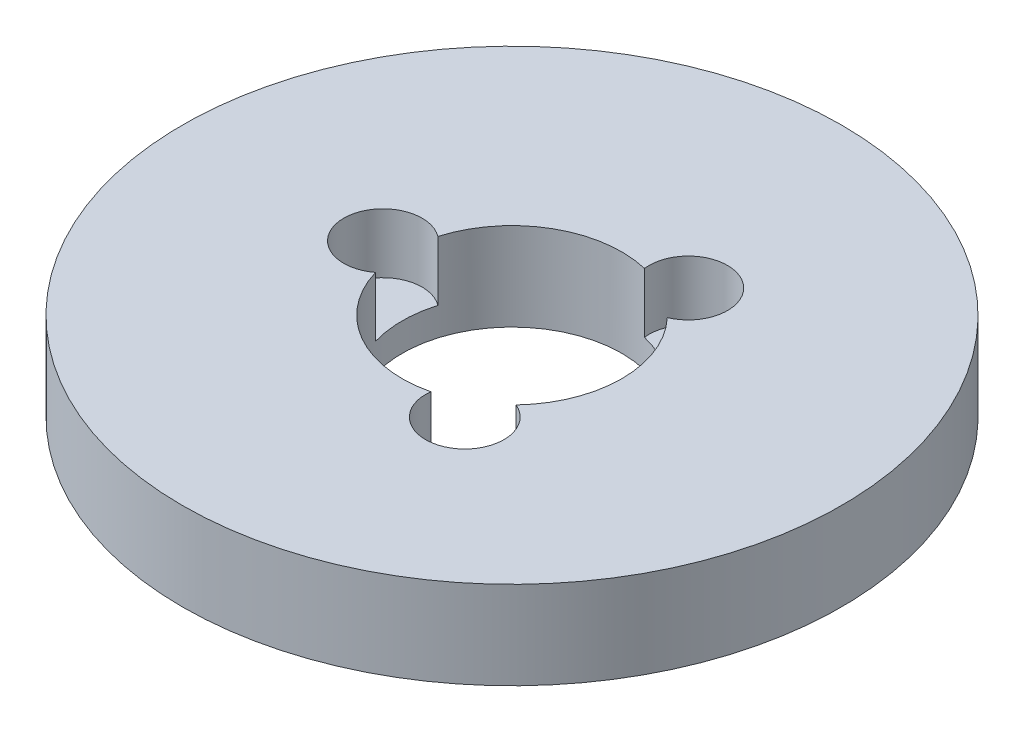
ISO-10303-21;
HEADER;
FILE_DESCRIPTION(('STEP AP214'),'2;1');
FILE_NAME('part.step','',(''),(''),'','','');
FILE_SCHEMA(('AUTOMOTIVE_DESIGN { 1 0 10303 214 1 1 1 1 }'));
ENDSEC;
DATA;
#1=APPLICATION_CONTEXT('core data for automotive mechanical design processes');
#2=APPLICATION_PROTOCOL_DEFINITION('international standard','automotive_design',2000,#1);
#3=PRODUCT_CONTEXT('',#1,'mechanical');
#4=PRODUCT('Part','Part','',(#3));
#5=PRODUCT_RELATED_PRODUCT_CATEGORY('part','',(#4));
#6=PRODUCT_DEFINITION_FORMATION('','',#4);
#7=PRODUCT_DEFINITION_CONTEXT('part definition',#1,'design');
#8=PRODUCT_DEFINITION('design','',#6,#7);
#9=PRODUCT_DEFINITION_SHAPE('','',#8);
#10=(LENGTH_UNIT() NAMED_UNIT(*) SI_UNIT(.MILLI.,.METRE.));
#11=(NAMED_UNIT(*) PLANE_ANGLE_UNIT() SI_UNIT($,.RADIAN.));
#12=(NAMED_UNIT(*) SI_UNIT($,.STERADIAN.) SOLID_ANGLE_UNIT());
#13=UNCERTAINTY_MEASURE_WITH_UNIT(LENGTH_MEASURE(1.E-05),#10,'distance_accuracy_value','');
#14=(GEOMETRIC_REPRESENTATION_CONTEXT(3) GLOBAL_UNCERTAINTY_ASSIGNED_CONTEXT((#13)) GLOBAL_UNIT_ASSIGNED_CONTEXT((#10,
#11,#12)) REPRESENTATION_CONTEXT('',''));
#15=CARTESIAN_POINT('',(0.,0.,0.));
#16=DIRECTION('',(0.,0.,1.));
#17=DIRECTION('',(1.,0.,0.));
#18=AXIS2_PLACEMENT_3D('',#15,#16,#17);
#19=CARTESIAN_POINT('',(0.,18.,0.));
#20=DIRECTION('',(0.,-1.,0.));
#21=DIRECTION('',(0.,0.,-1.));
#22=AXIS2_PLACEMENT_3D('',#19,#20,#21);
#23=CYLINDRICAL_SURFACE('',#22,67.5);
#24=CARTESIAN_POINT('',(0.,18.,0.));
#25=DIRECTION('',(0.,1.,0.));
#26=DIRECTION('',(0.,0.,1.));
#27=AXIS2_PLACEMENT_3D('',#24,#25,#26);
#28=CIRCLE('',#27,67.5);
#29=CARTESIAN_POINT('',(0.,18.,67.5));
#30=VERTEX_POINT('',#29);
#31=EDGE_CURVE('E126',#30,#30,#28,.T.);
#32=ORIENTED_EDGE('',*,*,#31,.F.);
#33=EDGE_LOOP('',(#32));
#34=FACE_BOUND('',#33,.T.);
#35=CARTESIAN_POINT('',(0.,0.,0.));
#36=DIRECTION('',(0.,1.,0.));
#37=DIRECTION('',(0.,0.,1.));
#38=AXIS2_PLACEMENT_3D('',#35,#36,#37);
#39=CIRCLE('',#38,67.5);
#40=CARTESIAN_POINT('',(0.,0.,67.5));
#41=VERTEX_POINT('',#40);
#42=EDGE_CURVE('E124',#41,#41,#39,.T.);
#43=ORIENTED_EDGE('',*,*,#42,.T.);
#44=EDGE_LOOP('',(#43));
#45=FACE_BOUND('',#44,.T.);
#46=ADVANCED_FACE('F39',(#34,#45),#23,.T.);
#47=CARTESIAN_POINT('',(0.,18.,0.));
#48=DIRECTION('',(0.,1.,0.));
#49=DIRECTION('',(0.,0.,1.));
#50=AXIS2_PLACEMENT_3D('',#47,#48,#49);
#51=PLANE('',#50);
#52=CARTESIAN_POINT('',(13.2172361759485,18.,22.8929245923799));
#53=DIRECTION('',(0.,1.,0.));
#54=DIRECTION('',(0.866025403784436,0.,-0.500000000000004));
#55=AXIS2_PLACEMENT_3D('',#52,#53,#54);
#56=CIRCLE('',#55,8.02501498432201);
#57=CARTESIAN_POINT('',(5.25674694959949,18.,21.8773081412654));
#58=VERTEX_POINT('',#57);
#59=CARTESIAN_POINT('',(16.3179311419563,18.,15.491130470252));
#60=VERTEX_POINT('',#59);
#61=EDGE_CURVE('E147',#58,#60,#56,.T.);
#62=ORIENTED_EDGE('',*,*,#61,.F.);
#63=CARTESIAN_POINT('',(0.,18.,0.));
#64=DIRECTION('',(0.,1.,0.));
#65=DIRECTION('',(0.,0.,1.));
#66=AXIS2_PLACEMENT_3D('',#63,#64,#65);
#67=CIRCLE('',#66,22.5);
#68=CARTESIAN_POINT('',(-21.5746780915557,18.,6.38617767101328));
#69=VERTEX_POINT('',#68);
#70=EDGE_CURVE('E118',#69,#58,#67,.T.);
#71=ORIENTED_EDGE('',*,*,#70,.F.);
#72=CARTESIAN_POINT('',(-26.4344723518967,18.,0.));
#73=DIRECTION('',(0.,1.,0.));
#74=DIRECTION('',(0.,0.,1.));
#75=AXIS2_PLACEMENT_3D('',#72,#73,#74);
#76=CIRCLE('',#75,8.02501498432201);
#77=CARTESIAN_POINT('',(-21.5746780915557,18.,-6.38617767101328));
#78=VERTEX_POINT('',#77);
#79=EDGE_CURVE('E113',#78,#69,#76,.T.);
#80=ORIENTED_EDGE('',*,*,#79,.F.);
#81=CARTESIAN_POINT('',(5.25674694959917,18.,-21.8773081412655));
#82=VERTEX_POINT('',#81);
#83=EDGE_CURVE('E106',#82,#78,#67,.T.);
#84=ORIENTED_EDGE('',*,*,#83,.F.);
#85=CARTESIAN_POINT('',(13.2172361759482,18.,-22.8929245923801));
#86=DIRECTION('',(0.,1.,0.));
#87=DIRECTION('',(-0.866025403784443,0.,-0.499999999999992));
#88=AXIS2_PLACEMENT_3D('',#85,#86,#87);
#89=CIRCLE('',#88,8.02501498432201);
#90=CARTESIAN_POINT('',(16.3179311419561,18.,-15.4911304702523));
#91=VERTEX_POINT('',#90);
#92=EDGE_CURVE('E90',#91,#82,#89,.T.);
#93=ORIENTED_EDGE('',*,*,#92,.F.);
#94=EDGE_CURVE('E116',#60,#91,#67,.T.);
#95=ORIENTED_EDGE('',*,*,#94,.F.);
#96=EDGE_LOOP('',(#62,#71,#80,#84,#93,#95));
#97=FACE_BOUND('',#96,.T.);
#98=ORIENTED_EDGE('',*,*,#31,.T.);
#99=EDGE_LOOP('',(#98));
#100=FACE_BOUND('',#99,.T.);
#101=ADVANCED_FACE('F115',(#97,#100),#51,.T.);
#102=CARTESIAN_POINT('',(0.,0.,0.));
#103=DIRECTION('',(0.,1.,0.));
#104=DIRECTION('',(0.,0.,1.));
#105=AXIS2_PLACEMENT_3D('',#102,#103,#104);
#106=PLANE('',#105);
#107=CARTESIAN_POINT('',(0.,0.,0.));
#108=DIRECTION('',(0.,1.,0.));
#109=DIRECTION('',(0.,0.,1.));
#110=AXIS2_PLACEMENT_3D('',#107,#108,#109);
#111=CIRCLE('',#110,22.5);
#112=CARTESIAN_POINT('',(0.,0.,22.5));
#113=VERTEX_POINT('',#112);
#114=EDGE_CURVE('E120',#113,#113,#111,.T.);
#115=ORIENTED_EDGE('',*,*,#114,.T.);
#116=EDGE_LOOP('',(#115));
#117=FACE_BOUND('',#116,.T.);
#118=ORIENTED_EDGE('',*,*,#42,.F.);
#119=EDGE_LOOP('',(#118));
#120=FACE_BOUND('',#119,.T.);
#121=ADVANCED_FACE('F164',(#117,#120),#106,.F.);
#122=CARTESIAN_POINT('',(0.,18.,0.));
#123=DIRECTION('',(0.,-1.,0.));
#124=DIRECTION('',(0.,0.,-1.));
#125=AXIS2_PLACEMENT_3D('',#122,#123,#124);
#126=CYLINDRICAL_SURFACE('',#125,22.5);
#127=DIRECTION('',(0.,1.,0.));
#128=VECTOR('',#127,1.);
#129=CARTESIAN_POINT('',(5.25674694959949,11.8857434492987,21.8773081412654));
#130=LINE('',#129,#128);
#131=CARTESIAN_POINT('',(5.25674694959949,5.77148689859742,21.8773081412654));
#132=VERTEX_POINT('',#131);
#133=EDGE_CURVE('E11',#132,#58,#130,.T.);
#134=ORIENTED_EDGE('',*,*,#133,.F.);
#135=CARTESIAN_POINT('',(0.,5.77148689859742,0.));
#136=DIRECTION('',(0.,1.,0.));
#137=DIRECTION('',(0.,0.,1.));
#138=AXIS2_PLACEMENT_3D('',#135,#136,#137);
#139=CIRCLE('',#138,22.5);
#140=CARTESIAN_POINT('',(16.3179311419563,5.77148689859742,15.491130470252));
#141=VERTEX_POINT('',#140);
#142=EDGE_CURVE('E144',#132,#141,#139,.T.);
#143=ORIENTED_EDGE('',*,*,#142,.T.);
#144=DIRECTION('',(0.,1.,0.));
#145=VECTOR('',#144,1.);
#146=CARTESIAN_POINT('',(16.3179311419563,11.8857434492987,15.491130470252));
#147=LINE('',#146,#145);
#148=EDGE_CURVE('E46',#60,#141,#147,.F.);
#149=ORIENTED_EDGE('',*,*,#148,.F.);
#150=ORIENTED_EDGE('',*,*,#94,.T.);
#151=DIRECTION('',(0.,1.,0.));
#152=VECTOR('',#151,1.);
#153=CARTESIAN_POINT('',(16.3179311419561,11.8857434492987,-15.4911304702523));
#154=LINE('',#153,#152);
#155=CARTESIAN_POINT('',(16.3179311419561,5.77148689859742,-15.4911304702523));
#156=VERTEX_POINT('',#155);
#157=EDGE_CURVE('E92',#156,#91,#154,.T.);
#158=ORIENTED_EDGE('',*,*,#157,.F.);
#159=CARTESIAN_POINT('',(0.,5.77148689859742,0.));
#160=DIRECTION('',(0.,1.,0.));
#161=DIRECTION('',(0.,0.,1.));
#162=AXIS2_PLACEMENT_3D('',#159,#160,#161);
#163=CIRCLE('',#162,22.5);
#164=CARTESIAN_POINT('',(5.25674694959917,5.77148689859742,-21.8773081412655));
#165=VERTEX_POINT('',#164);
#166=EDGE_CURVE('E107',#156,#165,#163,.T.);
#167=ORIENTED_EDGE('',*,*,#166,.T.);
#168=DIRECTION('',(0.,1.,0.));
#169=VECTOR('',#168,1.);
#170=CARTESIAN_POINT('',(5.25674694959917,11.8857434492987,-21.8773081412655));
#171=LINE('',#170,#169);
#172=EDGE_CURVE('E95',#82,#165,#171,.F.);
#173=ORIENTED_EDGE('',*,*,#172,.F.);
#174=ORIENTED_EDGE('',*,*,#83,.T.);
#175=DIRECTION('',(0.,1.,0.));
#176=VECTOR('',#175,1.);
#177=CARTESIAN_POINT('',(-21.5746780915556,11.8857434492987,-6.38617767101328));
#178=LINE('',#177,#176);
#179=CARTESIAN_POINT('',(-21.5746780915557,5.77148689859742,-6.38617767101328));
#180=VERTEX_POINT('',#179);
#181=EDGE_CURVE('E143',#180,#78,#178,.T.);
#182=ORIENTED_EDGE('',*,*,#181,.F.);
#183=CARTESIAN_POINT('',(0.,5.77148689859742,0.));
#184=DIRECTION('',(0.,1.,0.));
#185=DIRECTION('',(0.,0.,1.));
#186=AXIS2_PLACEMENT_3D('',#183,#184,#185);
#187=CIRCLE('',#186,22.5);
#188=CARTESIAN_POINT('',(-21.5746780915557,5.77148689859742,6.38617767101328));
#189=VERTEX_POINT('',#188);
#190=EDGE_CURVE('E132',#180,#189,#187,.T.);
#191=ORIENTED_EDGE('',*,*,#190,.T.);
#192=DIRECTION('',(0.,1.,0.));
#193=VECTOR('',#192,1.);
#194=CARTESIAN_POINT('',(-21.5746780915556,11.8857434492987,6.38617767101328));
#195=LINE('',#194,#193);
#196=EDGE_CURVE('E137',#69,#189,#195,.F.);
#197=ORIENTED_EDGE('',*,*,#196,.F.);
#198=ORIENTED_EDGE('',*,*,#70,.T.);
#199=EDGE_LOOP('',(#134,#143,#149,#150,#158,#167,#173,#174,#182,#191,#197,#198));
#200=FACE_BOUND('',#199,.T.);
#201=ORIENTED_EDGE('',*,*,#114,.F.);
#202=EDGE_LOOP('',(#201));
#203=FACE_BOUND('',#202,.T.);
#204=ADVANCED_FACE('F103',(#200,#203),#126,.F.);
#205=CARTESIAN_POINT('',(-26.4344723518967,5.77148689859742,0.));
#206=DIRECTION('',(0.,1.,0.));
#207=DIRECTION('',(0.,0.,1.));
#208=AXIS2_PLACEMENT_3D('',#205,#206,#207);
#209=CYLINDRICAL_SURFACE('',#208,8.02501498432201);
#210=ORIENTED_EDGE('',*,*,#181,.T.);
#211=ORIENTED_EDGE('',*,*,#79,.T.);
#212=ORIENTED_EDGE('',*,*,#196,.T.);
#213=CARTESIAN_POINT('',(-26.4344723518967,5.77148689859742,0.));
#214=DIRECTION('',(0.,1.,0.));
#215=DIRECTION('',(0.,0.,1.));
#216=AXIS2_PLACEMENT_3D('',#213,#214,#215);
#217=CIRCLE('',#216,8.02501498432201);
#218=EDGE_CURVE('E121',#180,#189,#217,.T.);
#219=ORIENTED_EDGE('',*,*,#218,.F.);
#220=EDGE_LOOP('',(#210,#211,#212,#219));
#221=FACE_BOUND('',#220,.T.);
#222=ADVANCED_FACE('F174',(#221),#209,.F.);
#223=CARTESIAN_POINT('',(-26.4344723518967,5.77148689859742,0.));
#224=DIRECTION('',(0.,1.,0.));
#225=DIRECTION('',(0.,0.,1.));
#226=AXIS2_PLACEMENT_3D('',#223,#224,#225);
#227=PLANE('',#226);
#228=ORIENTED_EDGE('',*,*,#218,.T.);
#229=ORIENTED_EDGE('',*,*,#190,.F.);
#230=EDGE_LOOP('',(#228,#229));
#231=FACE_BOUND('',#230,.T.);
#232=ADVANCED_FACE('F177',(#231),#227,.T.);
#233=CARTESIAN_POINT('',(13.2172361759482,5.77148689859742,-22.8929245923801));
#234=DIRECTION('',(0.,1.,0.));
#235=DIRECTION('',(0.,0.,1.));
#236=AXIS2_PLACEMENT_3D('',#233,#234,#235);
#237=CYLINDRICAL_SURFACE('',#236,8.02501498432201);
#238=ORIENTED_EDGE('',*,*,#157,.T.);
#239=ORIENTED_EDGE('',*,*,#92,.T.);
#240=ORIENTED_EDGE('',*,*,#172,.T.);
#241=CARTESIAN_POINT('',(13.2172361759482,5.77148689859742,-22.8929245923801));
#242=DIRECTION('',(0.,1.,0.));
#243=DIRECTION('',(-0.866025403784443,0.,-0.499999999999992));
#244=AXIS2_PLACEMENT_3D('',#241,#242,#243);
#245=CIRCLE('',#244,8.02501498432201);
#246=EDGE_CURVE('E56',#156,#165,#245,.T.);
#247=ORIENTED_EDGE('',*,*,#246,.F.);
#248=EDGE_LOOP('',(#238,#239,#240,#247));
#249=FACE_BOUND('',#248,.T.);
#250=ADVANCED_FACE('F93',(#249),#237,.F.);
#251=CARTESIAN_POINT('',(13.2172361759482,5.77148689859742,-22.8929245923801));
#252=DIRECTION('',(0.,1.,0.));
#253=DIRECTION('',(-0.866025403784443,0.,-0.499999999999992));
#254=AXIS2_PLACEMENT_3D('',#251,#252,#253);
#255=PLANE('',#254);
#256=ORIENTED_EDGE('',*,*,#246,.T.);
#257=ORIENTED_EDGE('',*,*,#166,.F.);
#258=EDGE_LOOP('',(#256,#257));
#259=FACE_BOUND('',#258,.T.);
#260=ADVANCED_FACE('F160',(#259),#255,.T.);
#261=CARTESIAN_POINT('',(13.2172361759485,5.77148689859742,22.8929245923799));
#262=DIRECTION('',(0.,1.,0.));
#263=DIRECTION('',(0.,0.,1.));
#264=AXIS2_PLACEMENT_3D('',#261,#262,#263);
#265=CYLINDRICAL_SURFACE('',#264,8.02501498432201);
#266=ORIENTED_EDGE('',*,*,#133,.T.);
#267=ORIENTED_EDGE('',*,*,#61,.T.);
#268=ORIENTED_EDGE('',*,*,#148,.T.);
#269=CARTESIAN_POINT('',(13.2172361759485,5.77148689859742,22.8929245923799));
#270=DIRECTION('',(0.,1.,0.));
#271=DIRECTION('',(0.866025403784436,0.,-0.500000000000004));
#272=AXIS2_PLACEMENT_3D('',#269,#270,#271);
#273=CIRCLE('',#272,8.02501498432201);
#274=EDGE_CURVE('E55',#132,#141,#273,.T.);
#275=ORIENTED_EDGE('',*,*,#274,.F.);
#276=EDGE_LOOP('',(#266,#267,#268,#275));
#277=FACE_BOUND('',#276,.T.);
#278=ADVANCED_FACE('F149',(#277),#265,.F.);
#279=CARTESIAN_POINT('',(13.2172361759485,5.77148689859742,22.8929245923799));
#280=DIRECTION('',(0.,1.,0.));
#281=DIRECTION('',(0.866025403784436,0.,-0.500000000000004));
#282=AXIS2_PLACEMENT_3D('',#279,#280,#281);
#283=PLANE('',#282);
#284=ORIENTED_EDGE('',*,*,#274,.T.);
#285=ORIENTED_EDGE('',*,*,#142,.F.);
#286=EDGE_LOOP('',(#284,#285));
#287=FACE_BOUND('',#286,.T.);
#288=ADVANCED_FACE('F151',(#287),#283,.T.);
#289=CLOSED_SHELL('',(#46,#101,#121,#204,#222,#232,#250,#260,#278,#288));
#290=MANIFOLD_SOLID_BREP('B2',#289);
#291=ADVANCED_BREP_SHAPE_REPRESENTATION('',(#18,#290),#14);
#292=SHAPE_DEFINITION_REPRESENTATION(#9,#291);
ENDSEC;
END-ISO-10303-21;
